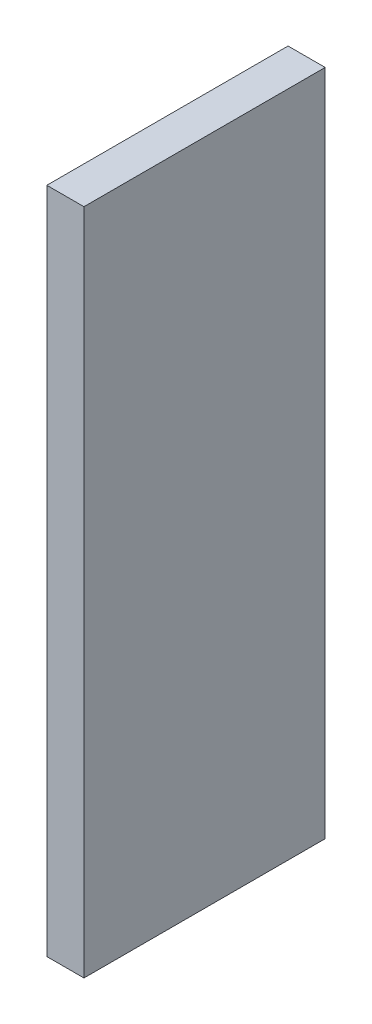
ISO-10303-21;
HEADER;
FILE_DESCRIPTION(('STEP AP214'),'2;1');
FILE_NAME('part.step','',(''),(''),'','','');
FILE_SCHEMA(('AUTOMOTIVE_DESIGN { 1 0 10303 214 1 1 1 1 }'));
ENDSEC;
DATA;
#1=APPLICATION_CONTEXT('core data for automotive mechanical design processes');
#2=APPLICATION_PROTOCOL_DEFINITION('international standard','automotive_design',2000,#1);
#3=PRODUCT_CONTEXT('',#1,'mechanical');
#4=PRODUCT('Part','Part','',(#3));
#5=PRODUCT_RELATED_PRODUCT_CATEGORY('part','',(#4));
#6=PRODUCT_DEFINITION_FORMATION('','',#4);
#7=PRODUCT_DEFINITION_CONTEXT('part definition',#1,'design');
#8=PRODUCT_DEFINITION('design','',#6,#7);
#9=PRODUCT_DEFINITION_SHAPE('','',#8);
#10=(LENGTH_UNIT() NAMED_UNIT(*) SI_UNIT(.MILLI.,.METRE.));
#11=(NAMED_UNIT(*) PLANE_ANGLE_UNIT() SI_UNIT($,.RADIAN.));
#12=(NAMED_UNIT(*) SI_UNIT($,.STERADIAN.) SOLID_ANGLE_UNIT());
#13=UNCERTAINTY_MEASURE_WITH_UNIT(LENGTH_MEASURE(1.E-05),#10,'distance_accuracy_value','');
#14=(GEOMETRIC_REPRESENTATION_CONTEXT(3) GLOBAL_UNCERTAINTY_ASSIGNED_CONTEXT((#13)) GLOBAL_UNIT_ASSIGNED_CONTEXT((#10,
#11,#12)) REPRESENTATION_CONTEXT('',''));
#15=CARTESIAN_POINT('',(0.,0.,0.));
#16=DIRECTION('',(0.,0.,1.));
#17=DIRECTION('',(1.,0.,0.));
#18=AXIS2_PLACEMENT_3D('',#15,#16,#17);
#19=CARTESIAN_POINT('',(0.,18.,-13.));
#20=DIRECTION('',(0.,-1.,0.));
#21=DIRECTION('',(0.,0.,-1.));
#22=AXIS2_PLACEMENT_3D('',#19,#20,#21);
#23=PLANE('',#22);
#24=DIRECTION('',(1.,0.,0.));
#25=VECTOR('',#24,1.);
#26=CARTESIAN_POINT('',(0.,18.,0.));
#27=LINE('',#26,#25);
#28=CARTESIAN_POINT('',(0.,18.,0.));
#29=VERTEX_POINT('',#28);
#30=CARTESIAN_POINT('',(2.,18.,0.));
#31=VERTEX_POINT('',#30);
#32=EDGE_CURVE('E88',#29,#31,#27,.T.);
#33=ORIENTED_EDGE('',*,*,#32,.T.);
#34=DIRECTION('',(0.,0.,1.));
#35=VECTOR('',#34,1.);
#36=CARTESIAN_POINT('',(2.,18.,-13.));
#37=LINE('',#36,#35);
#38=CARTESIAN_POINT('',(2.,18.,-13.));
#39=VERTEX_POINT('',#38);
#40=EDGE_CURVE('E42',#39,#31,#37,.T.);
#41=ORIENTED_EDGE('',*,*,#40,.F.);
#42=DIRECTION('',(1.,0.,0.));
#43=VECTOR('',#42,1.);
#44=CARTESIAN_POINT('',(0.,18.,-13.));
#45=LINE('',#44,#43);
#46=CARTESIAN_POINT('',(0.,18.,-13.));
#47=VERTEX_POINT('',#46);
#48=EDGE_CURVE('E80',#47,#39,#45,.T.);
#49=ORIENTED_EDGE('',*,*,#48,.F.);
#50=DIRECTION('',(0.,0.,1.));
#51=VECTOR('',#50,1.);
#52=CARTESIAN_POINT('',(0.,18.,-13.));
#53=LINE('',#52,#51);
#54=EDGE_CURVE('E11',#47,#29,#53,.T.);
#55=ORIENTED_EDGE('',*,*,#54,.T.);
#56=EDGE_LOOP('',(#33,#41,#49,#55));
#57=FACE_BOUND('',#56,.T.);
#58=ADVANCED_FACE('F34',(#57),#23,.F.);
#59=CARTESIAN_POINT('',(2.,0.,-13.));
#60=DIRECTION('',(-1.,0.,0.));
#61=DIRECTION('',(0.,0.,1.));
#62=AXIS2_PLACEMENT_3D('',#59,#60,#61);
#63=PLANE('',#62);
#64=DIRECTION('',(0.,-1.,0.));
#65=VECTOR('',#64,1.);
#66=CARTESIAN_POINT('',(2.,0.,0.));
#67=LINE('',#66,#65);
#68=CARTESIAN_POINT('',(2.,-18.,0.));
#69=VERTEX_POINT('',#68);
#70=EDGE_CURVE('E67',#31,#69,#67,.T.);
#71=ORIENTED_EDGE('',*,*,#70,.T.);
#72=DIRECTION('',(0.,0.,1.));
#73=VECTOR('',#72,1.);
#74=CARTESIAN_POINT('',(2.,-18.,-13.));
#75=LINE('',#74,#73);
#76=CARTESIAN_POINT('',(2.,-18.,-13.));
#77=VERTEX_POINT('',#76);
#78=EDGE_CURVE('E89',#77,#69,#75,.T.);
#79=ORIENTED_EDGE('',*,*,#78,.F.);
#80=DIRECTION('',(0.,-1.,0.));
#81=VECTOR('',#80,1.);
#82=CARTESIAN_POINT('',(2.,18.,-13.));
#83=LINE('',#82,#81);
#84=EDGE_CURVE('E84',#39,#77,#83,.T.);
#85=ORIENTED_EDGE('',*,*,#84,.F.);
#86=ORIENTED_EDGE('',*,*,#40,.T.);
#87=EDGE_LOOP('',(#71,#79,#85,#86));
#88=FACE_BOUND('',#87,.T.);
#89=ADVANCED_FACE('F90',(#88),#63,.F.);
#90=CARTESIAN_POINT('',(0.,-18.,-13.));
#91=DIRECTION('',(0.,1.,0.));
#92=DIRECTION('',(0.,0.,1.));
#93=AXIS2_PLACEMENT_3D('',#90,#91,#92);
#94=PLANE('',#93);
#95=DIRECTION('',(-1.,0.,0.));
#96=VECTOR('',#95,1.);
#97=CARTESIAN_POINT('',(0.,-18.,0.));
#98=LINE('',#97,#96);
#99=CARTESIAN_POINT('',(0.,-18.,0.));
#100=VERTEX_POINT('',#99);
#101=EDGE_CURVE('E74',#69,#100,#98,.T.);
#102=ORIENTED_EDGE('',*,*,#101,.T.);
#103=DIRECTION('',(0.,0.,1.));
#104=VECTOR('',#103,1.);
#105=CARTESIAN_POINT('',(0.,-18.,-13.));
#106=LINE('',#105,#104);
#107=CARTESIAN_POINT('',(0.,-18.,-13.));
#108=VERTEX_POINT('',#107);
#109=EDGE_CURVE('E94',#108,#100,#106,.T.);
#110=ORIENTED_EDGE('',*,*,#109,.F.);
#111=DIRECTION('',(-1.,0.,0.));
#112=VECTOR('',#111,1.);
#113=CARTESIAN_POINT('',(0.,-18.,-13.));
#114=LINE('',#113,#112);
#115=EDGE_CURVE('E92',#77,#108,#114,.T.);
#116=ORIENTED_EDGE('',*,*,#115,.F.);
#117=ORIENTED_EDGE('',*,*,#78,.T.);
#118=EDGE_LOOP('',(#102,#110,#116,#117));
#119=FACE_BOUND('',#118,.T.);
#120=ADVANCED_FACE('F104',(#119),#94,.F.);
#121=CARTESIAN_POINT('',(0.,0.,-13.));
#122=DIRECTION('',(1.,0.,0.));
#123=DIRECTION('',(0.,0.,-1.));
#124=AXIS2_PLACEMENT_3D('',#121,#122,#123);
#125=PLANE('',#124);
#126=DIRECTION('',(0.,1.,0.));
#127=VECTOR('',#126,1.);
#128=CARTESIAN_POINT('',(0.,0.,0.));
#129=LINE('',#128,#127);
#130=EDGE_CURVE('E101',#100,#29,#129,.T.);
#131=ORIENTED_EDGE('',*,*,#130,.T.);
#132=ORIENTED_EDGE('',*,*,#54,.F.);
#133=DIRECTION('',(0.,1.,0.));
#134=VECTOR('',#133,1.);
#135=CARTESIAN_POINT('',(0.,18.,-13.));
#136=LINE('',#135,#134);
#137=EDGE_CURVE('E50',#108,#47,#136,.T.);
#138=ORIENTED_EDGE('',*,*,#137,.F.);
#139=ORIENTED_EDGE('',*,*,#109,.T.);
#140=EDGE_LOOP('',(#131,#132,#138,#139));
#141=FACE_BOUND('',#140,.T.);
#142=ADVANCED_FACE('F108',(#141),#125,.F.);
#143=CARTESIAN_POINT('',(0.,0.,-13.));
#144=DIRECTION('',(0.,0.,1.));
#145=DIRECTION('',(1.,0.,0.));
#146=AXIS2_PLACEMENT_3D('',#143,#144,#145);
#147=PLANE('',#146);
#148=ORIENTED_EDGE('',*,*,#137,.T.);
#149=ORIENTED_EDGE('',*,*,#48,.T.);
#150=ORIENTED_EDGE('',*,*,#84,.T.);
#151=ORIENTED_EDGE('',*,*,#115,.T.);
#152=EDGE_LOOP('',(#148,#149,#150,#151));
#153=FACE_BOUND('',#152,.T.);
#154=ADVANCED_FACE('F82',(#153),#147,.F.);
#155=CARTESIAN_POINT('',(0.,0.,0.));
#156=DIRECTION('',(0.,0.,1.));
#157=DIRECTION('',(1.,0.,0.));
#158=AXIS2_PLACEMENT_3D('',#155,#156,#157);
#159=PLANE('',#158);
#160=ORIENTED_EDGE('',*,*,#32,.F.);
#161=ORIENTED_EDGE('',*,*,#130,.F.);
#162=ORIENTED_EDGE('',*,*,#101,.F.);
#163=ORIENTED_EDGE('',*,*,#70,.F.);
#164=EDGE_LOOP('',(#160,#161,#162,#163));
#165=FACE_BOUND('',#164,.T.);
#166=ADVANCED_FACE('F107',(#165),#159,.T.);
#167=CLOSED_SHELL('',(#58,#89,#120,#142,#154,#166));
#168=MANIFOLD_SOLID_BREP('B2',#167);
#169=ADVANCED_BREP_SHAPE_REPRESENTATION('',(#18,#168),#14);
#170=SHAPE_DEFINITION_REPRESENTATION(#9,#169);
ENDSEC;
END-ISO-10303-21;
